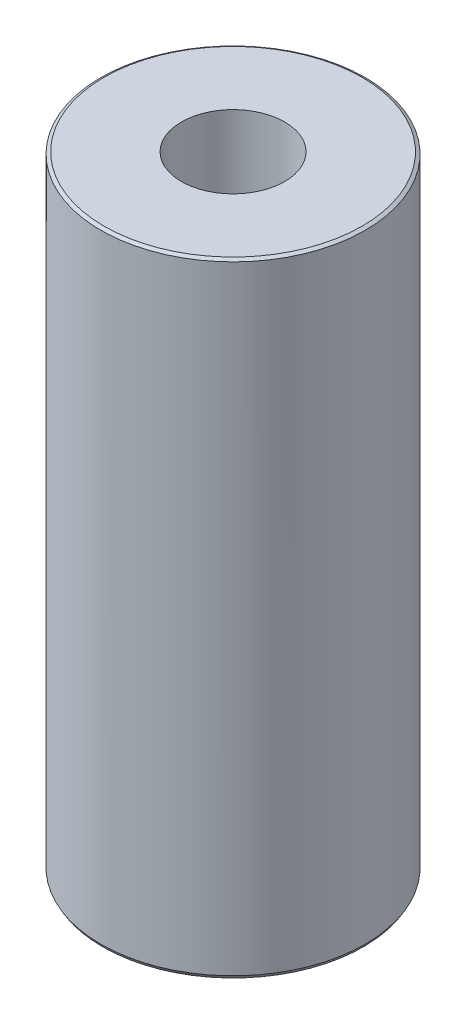
ISO-10303-21;
HEADER;
FILE_DESCRIPTION(('STEP AP214'),'2;1');
FILE_NAME('part.step','',(''),(''),'','','');
FILE_SCHEMA(('AUTOMOTIVE_DESIGN { 1 0 10303 214 1 1 1 1 }'));
ENDSEC;
DATA;
#1=APPLICATION_CONTEXT('core data for automotive mechanical design processes');
#2=APPLICATION_PROTOCOL_DEFINITION('international standard','automotive_design',2000,#1);
#3=PRODUCT_CONTEXT('',#1,'mechanical');
#4=PRODUCT('Part','Part','',(#3));
#5=PRODUCT_RELATED_PRODUCT_CATEGORY('part','',(#4));
#6=PRODUCT_DEFINITION_FORMATION('','',#4);
#7=PRODUCT_DEFINITION_CONTEXT('part definition',#1,'design');
#8=PRODUCT_DEFINITION('design','',#6,#7);
#9=PRODUCT_DEFINITION_SHAPE('','',#8);
#10=(LENGTH_UNIT() NAMED_UNIT(*) SI_UNIT(.MILLI.,.METRE.));
#11=(NAMED_UNIT(*) PLANE_ANGLE_UNIT() SI_UNIT($,.RADIAN.));
#12=(NAMED_UNIT(*) SI_UNIT($,.STERADIAN.) SOLID_ANGLE_UNIT());
#13=UNCERTAINTY_MEASURE_WITH_UNIT(LENGTH_MEASURE(1.E-05),#10,'distance_accuracy_value','');
#14=(GEOMETRIC_REPRESENTATION_CONTEXT(3) GLOBAL_UNCERTAINTY_ASSIGNED_CONTEXT((#13)) GLOBAL_UNIT_ASSIGNED_CONTEXT((#10,
#11,#12)) REPRESENTATION_CONTEXT('',''));
#15=CARTESIAN_POINT('',(0.,0.,0.));
#16=DIRECTION('',(0.,0.,1.));
#17=DIRECTION('',(1.,0.,0.));
#18=AXIS2_PLACEMENT_3D('',#15,#16,#17);
#19=CARTESIAN_POINT('',(0.,117.854066080354,0.));
#20=DIRECTION('',(0.,-1.,0.));
#21=DIRECTION('',(0.,0.,-1.));
#22=AXIS2_PLACEMENT_3D('',#19,#20,#21);
#23=CYLINDRICAL_SURFACE('',#22,25.);
#24=CARTESIAN_POINT('',(0.,117.499102379698,0.));
#25=DIRECTION('',(0.,1.,0.));
#26=DIRECTION('',(0.,0.,1.));
#27=AXIS2_PLACEMENT_3D('',#24,#25,#26);
#28=CIRCLE('',#27,25.);
#29=CARTESIAN_POINT('',(0.,117.499102379698,-25.));
#30=VERTEX_POINT('',#29);
#31=EDGE_CURVE('E50',#30,#30,#28,.F.);
#32=CARTESIAN_POINT('',(0.,0.614815164379293,0.));
#33=DIRECTION('',(0.,1.,0.));
#34=DIRECTION('',(0.,0.,1.));
#35=AXIS2_PLACEMENT_3D('',#32,#33,#34);
#36=CIRCLE('',#35,25.);
#37=CARTESIAN_POINT('',(0.,0.614815164379293,-25.));
#38=VERTEX_POINT('',#37);
#39=EDGE_CURVE('E51',#38,#38,#36,.T.);
#40=CARTESIAN_POINT('',(0.,117.499102379698,-25.));
#41=CARTESIAN_POINT('',(0.,116.281557721205,-25.));
#42=CARTESIAN_POINT('',(0.,115.064013062712,-25.));
#43=CARTESIAN_POINT('',(0.,112.628923745726,-25.));
#44=CARTESIAN_POINT('',(0.,111.411379087234,-25.));
#45=CARTESIAN_POINT('',(0.,108.976289770248,-25.));
#46=CARTESIAN_POINT('',(0.,107.758745111755,-25.));
#47=CARTESIAN_POINT('',(0.,105.323655794769,-25.));
#48=CARTESIAN_POINT('',(0.,104.106111136276,-25.));
#49=CARTESIAN_POINT('',(0.,101.67102181929,-25.));
#50=CARTESIAN_POINT('',(0.,100.453477160797,-25.));
#51=CARTESIAN_POINT('',(0.,98.0183878438116,-25.));
#52=CARTESIAN_POINT('',(0.,96.8008431853187,-25.));
#53=CARTESIAN_POINT('',(0.,94.3657538683329,-25.));
#54=CARTESIAN_POINT('',(0.,93.14820920984,-25.));
#55=CARTESIAN_POINT('',(0.,90.7131198928542,-25.));
#56=CARTESIAN_POINT('',(0.,89.4955752343613,-25.));
#57=CARTESIAN_POINT('',(0.,87.0604859173755,-25.));
#58=CARTESIAN_POINT('',(0.,85.8429412588825,-25.));
#59=CARTESIAN_POINT('',(0.,83.4078519418968,-25.));
#60=CARTESIAN_POINT('',(0.,82.1903072834038,-25.));
#61=CARTESIAN_POINT('',(0.,79.755217966418,-25.));
#62=CARTESIAN_POINT('',(0.,78.5376733079251,-25.));
#63=CARTESIAN_POINT('',(0.,76.1025839909393,-25.));
#64=CARTESIAN_POINT('',(0.,74.8850393324464,-25.));
#65=CARTESIAN_POINT('',(0.,72.4499500154606,-25.));
#66=CARTESIAN_POINT('',(0.,71.2324053569677,-25.));
#67=CARTESIAN_POINT('',(0.,68.7973160399819,-25.));
#68=CARTESIAN_POINT('',(0.,67.579771381489,-25.));
#69=CARTESIAN_POINT('',(0.,65.1446820645032,-25.));
#70=CARTESIAN_POINT('',(0.,63.9271374060103,-25.));
#71=CARTESIAN_POINT('',(0.,61.4920480890245,-25.));
#72=CARTESIAN_POINT('',(0.,60.2745034305316,-25.));
#73=CARTESIAN_POINT('',(0.,57.8394141135458,-25.));
#74=CARTESIAN_POINT('',(0.,56.6218694550529,-25.));
#75=CARTESIAN_POINT('',(0.,54.1867801380671,-25.));
#76=CARTESIAN_POINT('',(0.,52.9692354795741,-25.));
#77=CARTESIAN_POINT('',(0.,50.5341461625883,-25.));
#78=CARTESIAN_POINT('',(0.,49.3166015040954,-25.));
#79=CARTESIAN_POINT('',(0.,46.8815121871096,-25.));
#80=CARTESIAN_POINT('',(0.,45.6639675286167,-25.));
#81=CARTESIAN_POINT('',(0.,43.2288782116309,-25.));
#82=CARTESIAN_POINT('',(0.,42.011333553138,-25.));
#83=CARTESIAN_POINT('',(0.,39.5762442361522,-25.));
#84=CARTESIAN_POINT('',(0.,38.3586995776593,-25.));
#85=CARTESIAN_POINT('',(0.,35.9236102606735,-25.));
#86=CARTESIAN_POINT('',(0.,34.7060656021806,-25.));
#87=CARTESIAN_POINT('',(0.,32.2709762851948,-25.));
#88=CARTESIAN_POINT('',(0.,31.0534316267019,-25.));
#89=CARTESIAN_POINT('',(0.,28.6183423097161,-25.));
#90=CARTESIAN_POINT('',(0.,27.4007976512232,-25.));
#91=CARTESIAN_POINT('',(0.,24.9657083342374,-25.));
#92=CARTESIAN_POINT('',(0.,23.7481636757445,-25.));
#93=CARTESIAN_POINT('',(0.,21.3130743587587,-25.));
#94=CARTESIAN_POINT('',(0.,20.0955297002658,-25.));
#95=CARTESIAN_POINT('',(0.,17.6604403832799,-25.));
#96=CARTESIAN_POINT('',(0.,16.442895724787,-25.));
#97=CARTESIAN_POINT('',(0.,14.0078064078012,-25.));
#98=CARTESIAN_POINT('',(0.,12.7902617493083,-25.));
#99=CARTESIAN_POINT('',(0.,10.3551724323225,-25.));
#100=CARTESIAN_POINT('',(0.,9.13762777382962,-25.));
#101=CARTESIAN_POINT('',(0.,6.70253845684382,-25.));
#102=CARTESIAN_POINT('',(0.,5.48499379835091,-25.));
#103=CARTESIAN_POINT('',(0.,3.0499044813651,-25.));
#104=CARTESIAN_POINT('',(0.,1.8323598228722,-25.));
#105=CARTESIAN_POINT('',(0.,0.614815164379293,-25.));
#106=B_SPLINE_CURVE_WITH_KNOTS('',3,(#40,#41,#42,#43,#44,#45,#46,#47,#48,#49,#50,#51,#52,#53,
#54,#55,#56,#57,#58,#59,#60,#61,#62,#63,#64,#65,#66,#67,#68,#69,#70,#71,#72,#73,#74,#75,#76,#77,
#78,#79,#80,#81,#82,#83,#84,#85,#86,#87,#88,#89,#90,#91,#92,#93,#94,#95,#96,#97,#98,#99,#100,
#101,#102,#103,#104,#105),.UNSPECIFIED.,.F.,.F.,(4,2,2,2,2,2,2,2,2,2,2,2,2,2,2,2,2,2,2,2,2,2,2,
2,2,2,2,2,2,2,2,2,4),(0.,3.6526339754787,7.30526795095741,10.9579019264361,14.6105359019148,
18.2631698773935,21.9158038528723,25.568437828351,29.2210718038297,32.8737057793084,
36.5263397547871,40.1789737302658,43.8316077057445,47.4842416812232,51.1368756567019,
54.7895096321806,58.4421436076594,62.0947775831381,65.7474115586168,69.4000455340955,
73.0526795095742,76.7053134850529,80.3579474605316,84.0105814360103,87.663215411489,
91.3158493869678,94.9684833624465,98.6211173379252,102.273751313404,105.926385288883,
109.579019264361,113.23165323984,116.884287215319),.UNSPECIFIED.);
#107=EDGE_CURVE('BSEAM39',#30,#38,#106,.T.);
#108=ORIENTED_EDGE('',*,*,#31,.T.);
#109=ORIENTED_EDGE('',*,*,#39,.T.);
#110=ORIENTED_EDGE('',*,*,#107,.T.);
#111=ORIENTED_EDGE('',*,*,#107,.F.);
#112=EDGE_LOOP('',(#108,#110,#109,#111));
#113=FACE_BOUND('',#112,.T.);
#114=ADVANCED_FACE('F39',(#113),#23,.T.);
#115=CARTESIAN_POINT('',(0.,117.854066080354,0.));
#116=DIRECTION('',(0.,1.,0.));
#117=DIRECTION('',(0.,0.,1.));
#118=AXIS2_PLACEMENT_3D('',#115,#116,#117);
#119=PLANE('',#118);
#120=CARTESIAN_POINT('',(0.,117.854066080354,0.));
#121=DIRECTION('',(0.,1.,0.));
#122=DIRECTION('',(0.,0.,1.));
#123=AXIS2_PLACEMENT_3D('',#120,#121,#122);
#124=CIRCLE('',#123,24.385184835621);
#125=CARTESIAN_POINT('',(0.,117.854066080354,24.385184835621));
#126=VERTEX_POINT('',#125);
#127=EDGE_CURVE('E54',#126,#126,#124,.T.);
#128=ORIENTED_EDGE('',*,*,#127,.T.);
#129=EDGE_LOOP('',(#128));
#130=FACE_BOUND('',#129,.T.);
#131=CARTESIAN_POINT('',(0.,117.854066080354,0.));
#132=DIRECTION('',(0.,1.,0.));
#133=DIRECTION('',(0.,0.,1.));
#134=AXIS2_PLACEMENT_3D('',#131,#132,#133);
#135=CIRCLE('',#134,9.76173491763838);
#136=CARTESIAN_POINT('',(0.,117.854066080354,-9.76173491763838));
#137=VERTEX_POINT('',#136);
#138=EDGE_CURVE('E58',#137,#137,#135,.T.);
#139=ORIENTED_EDGE('',*,*,#138,.F.);
#140=EDGE_LOOP('',(#139));
#141=FACE_BOUND('',#140,.T.);
#142=ADVANCED_FACE('F69',(#130,#141),#119,.T.);
#143=CARTESIAN_POINT('',(0.,0.,0.));
#144=DIRECTION('',(0.,1.,0.));
#145=DIRECTION('',(0.,0.,1.));
#146=AXIS2_PLACEMENT_3D('',#143,#144,#145);
#147=PLANE('',#146);
#148=CARTESIAN_POINT('',(0.,0.,0.));
#149=DIRECTION('',(0.,1.,0.));
#150=DIRECTION('',(0.,0.,1.));
#151=AXIS2_PLACEMENT_3D('',#148,#149,#150);
#152=CIRCLE('',#151,24.6450362993438);
#153=CARTESIAN_POINT('',(0.,0.,24.6450362993438));
#154=VERTEX_POINT('',#153);
#155=EDGE_CURVE('E10',#154,#154,#152,.F.);
#156=ORIENTED_EDGE('',*,*,#155,.T.);
#157=EDGE_LOOP('',(#156));
#158=FACE_BOUND('',#157,.T.);
#159=CARTESIAN_POINT('',(0.,0.,0.));
#160=DIRECTION('',(0.,1.,0.));
#161=DIRECTION('',(0.,0.,1.));
#162=AXIS2_PLACEMENT_3D('',#159,#160,#161);
#163=CIRCLE('',#162,9.76173491763838);
#164=CARTESIAN_POINT('',(0.,0.,-9.76173491763838));
#165=VERTEX_POINT('',#164);
#166=EDGE_CURVE('E63',#165,#165,#163,.T.);
#167=ORIENTED_EDGE('',*,*,#166,.T.);
#168=EDGE_LOOP('',(#167));
#169=FACE_BOUND('',#168,.T.);
#170=ADVANCED_FACE('F75',(#158,#169),#147,.F.);
#171=CARTESIAN_POINT('',(0.,117.854066080354,0.));
#172=DIRECTION('',(0.,-1.,0.));
#173=DIRECTION('',(0.,0.,-1.));
#174=AXIS2_PLACEMENT_3D('',#171,#172,#173);
#175=CYLINDRICAL_SURFACE('',#174,9.76173491763838);
#176=CARTESIAN_POINT('',(0.,117.854066080354,-9.76173491763838));
#177=CARTESIAN_POINT('',(0.,116.626419558684,-9.76173491763838));
#178=CARTESIAN_POINT('',(0.,115.398773037013,-9.76173491763838));
#179=CARTESIAN_POINT('',(0.,112.943479993673,-9.76173491763838));
#180=CARTESIAN_POINT('',(0.,111.715833472002,-9.76173491763838));
#181=CARTESIAN_POINT('',(0.,109.260540428662,-9.76173491763838));
#182=CARTESIAN_POINT('',(0.,108.032893906991,-9.76173491763838));
#183=CARTESIAN_POINT('',(0.,105.577600863651,-9.76173491763838));
#184=CARTESIAN_POINT('',(0.,104.34995434198,-9.76173491763838));
#185=CARTESIAN_POINT('',(0.,101.894661298639,-9.76173491763838));
#186=CARTESIAN_POINT('',(0.,100.667014776969,-9.76173491763838));
#187=CARTESIAN_POINT('',(0.,98.2117217336284,-9.76173491763838));
#188=CARTESIAN_POINT('',(0.,96.9840752119581,-9.76173491763838));
#189=CARTESIAN_POINT('',(0.,94.5287821686174,-9.76173491763838));
#190=CARTESIAN_POINT('',(0.,93.301135646947,-9.76173491763838));
#191=CARTESIAN_POINT('',(0.,90.8458426036063,-9.76173491763838));
#192=CARTESIAN_POINT('',(0.,89.6181960819359,-9.76173491763838));
#193=CARTESIAN_POINT('',(0.,87.1629030385952,-9.76173491763838));
#194=CARTESIAN_POINT('',(0.,85.9352565169249,-9.76173491763838));
#195=CARTESIAN_POINT('',(0.,83.4799634735842,-9.76173491763838));
#196=CARTESIAN_POINT('',(0.,82.2523169519138,-9.76173491763838));
#197=CARTESIAN_POINT('',(0.,79.7970239085731,-9.76173491763838));
#198=CARTESIAN_POINT('',(0.,78.5693773869027,-9.76173491763838));
#199=CARTESIAN_POINT('',(0.,76.114084343562,-9.76173491763838));
#200=CARTESIAN_POINT('',(0.,74.8864378218917,-9.76173491763838));
#201=CARTESIAN_POINT('',(0.,72.431144778551,-9.76173491763838));
#202=CARTESIAN_POINT('',(0.,71.2034982568806,-9.76173491763838));
#203=CARTESIAN_POINT('',(0.,68.7482052135399,-9.76173491763838));
#204=CARTESIAN_POINT('',(0.,67.5205586918695,-9.76173491763838));
#205=CARTESIAN_POINT('',(0.,65.0652656485288,-9.76173491763838));
#206=CARTESIAN_POINT('',(0.,63.8376191268585,-9.76173491763838));
#207=CARTESIAN_POINT('',(0.,61.3823260835178,-9.76173491763838));
#208=CARTESIAN_POINT('',(0.,60.1546795618474,-9.76173491763838));
#209=CARTESIAN_POINT('',(0.,57.6993865185067,-9.76173491763838));
#210=CARTESIAN_POINT('',(0.,56.4717399968363,-9.76173491763838));
#211=CARTESIAN_POINT('',(0.,54.0164469534956,-9.76173491763838));
#212=CARTESIAN_POINT('',(0.,52.7888004318253,-9.76173491763838));
#213=CARTESIAN_POINT('',(0.,50.3335073884846,-9.76173491763838));
#214=CARTESIAN_POINT('',(0.,49.1058608668142,-9.76173491763838));
#215=CARTESIAN_POINT('',(0.,46.6505678234735,-9.76173491763838));
#216=CARTESIAN_POINT('',(0.,45.4229213018031,-9.76173491763838));
#217=CARTESIAN_POINT('',(0.,42.9676282584624,-9.76173491763838));
#218=CARTESIAN_POINT('',(0.,41.7399817367921,-9.76173491763838));
#219=CARTESIAN_POINT('',(0.,39.2846886934514,-9.76173491763838));
#220=CARTESIAN_POINT('',(0.,38.057042171781,-9.76173491763838));
#221=CARTESIAN_POINT('',(0.,35.6017491284403,-9.76173491763838));
#222=CARTESIAN_POINT('',(0.,34.3741026067699,-9.76173491763838));
#223=CARTESIAN_POINT('',(0.,31.9188095634292,-9.76173491763838));
#224=CARTESIAN_POINT('',(0.,30.6911630417589,-9.76173491763838));
#225=CARTESIAN_POINT('',(0.,28.2358699984182,-9.76173491763838));
#226=CARTESIAN_POINT('',(0.,27.0082234767478,-9.76173491763838));
#227=CARTESIAN_POINT('',(0.,24.5529304334071,-9.76173491763838));
#228=CARTESIAN_POINT('',(0.,23.3252839117367,-9.76173491763838));
#229=CARTESIAN_POINT('',(0.,20.869990868396,-9.76173491763838));
#230=CARTESIAN_POINT('',(0.,19.6423443467257,-9.76173491763838));
#231=CARTESIAN_POINT('',(0.,17.187051303385,-9.76173491763838));
#232=CARTESIAN_POINT('',(0.,15.9594047817146,-9.76173491763838));
#233=CARTESIAN_POINT('',(0.,13.5041117383739,-9.76173491763838));
#234=CARTESIAN_POINT('',(0.,12.2764652167035,-9.76173491763838));
#235=CARTESIAN_POINT('',(0.,9.82117217336283,-9.76173491763838));
#236=CARTESIAN_POINT('',(0.,8.59352565169248,-9.76173491763838));
#237=CARTESIAN_POINT('',(0.,6.13823260835176,-9.76173491763838));
#238=CARTESIAN_POINT('',(0.,4.91058608668141,-9.76173491763838));
#239=CARTESIAN_POINT('',(0.,2.45529304334069,-9.76173491763838));
#240=CARTESIAN_POINT('',(0.,1.22764652167034,-9.76173491763838));
#241=CARTESIAN_POINT('',(0.,0.,-9.76173491763838));
#242=B_SPLINE_CURVE_WITH_KNOTS('',3,(#176,#177,#178,#179,#180,#181,#182,#183,#184,#185,#186,
#187,#188,#189,#190,#191,#192,#193,#194,#195,#196,#197,#198,#199,#200,#201,#202,#203,#204,#205,
#206,#207,#208,#209,#210,#211,#212,#213,#214,#215,#216,#217,#218,#219,#220,#221,#222,#223,#224,
#225,#226,#227,#228,#229,#230,#231,#232,#233,#234,#235,#236,#237,#238,#239,#240,#241),
.UNSPECIFIED.,.F.,.F.,(4,2,2,2,2,2,2,2,2,2,2,2,2,2,2,2,2,2,2,2,2,2,2,2,2,2,2,2,2,2,2,2,4),(0.,
3.68293956501106,7.36587913002212,11.0488186950332,14.7317582600443,18.4146978250553,
22.0976373900664,25.7805769550775,29.4635165200885,33.1464560850996,36.8293956501107,
40.5123352151217,44.1952747801328,47.8782143451438,51.5611539101549,55.244093475166,
58.9270330401771,62.6099726051881,66.2929121701992,69.9758517352103,73.6587913002213,
77.3417308652324,81.0246704302435,84.7076099952545,88.3905495602656,92.0734891252767,
95.7564286902877,99.4393682552988,103.12230782031,106.805247385321,110.488186950332,
114.171126515343,117.854066080354),.UNSPECIFIED.);
#243=EDGE_CURVE('BSEAM70',#137,#165,#242,.T.);
#244=ORIENTED_EDGE('',*,*,#138,.T.);
#245=ORIENTED_EDGE('',*,*,#166,.F.);
#246=ORIENTED_EDGE('',*,*,#243,.T.);
#247=ORIENTED_EDGE('',*,*,#243,.F.);
#248=EDGE_LOOP('',(#244,#246,#245,#247));
#249=FACE_BOUND('',#248,.T.);
#250=ADVANCED_FACE('F70',(#249),#175,.F.);
#251=CARTESIAN_POINT('',(0.,117.854066080354,0.));
#252=DIRECTION('',(0.,-1.,0.));
#253=DIRECTION('',(0.,0.,-1.));
#254=AXIS2_PLACEMENT_3D('',#251,#252,#253);
#255=CONICAL_SURFACE('',#254,24.385184835621,1.0471975511966);
#256=ORIENTED_EDGE('',*,*,#31,.F.);
#257=EDGE_LOOP('',(#256));
#258=FACE_BOUND('',#257,.T.);
#259=ORIENTED_EDGE('',*,*,#127,.F.);
#260=EDGE_LOOP('',(#259));
#261=FACE_BOUND('',#260,.T.);
#262=ADVANCED_FACE('F81',(#258,#261),#255,.T.);
#263=CARTESIAN_POINT('',(0.,0.614815164379293,0.));
#264=DIRECTION('',(0.,1.,0.));
#265=DIRECTION('',(0.,0.,1.));
#266=AXIS2_PLACEMENT_3D('',#263,#264,#265);
#267=CONICAL_SURFACE('',#266,25.,0.523598775598298);
#268=ORIENTED_EDGE('',*,*,#155,.F.);
#269=EDGE_LOOP('',(#268));
#270=FACE_BOUND('',#269,.T.);
#271=ORIENTED_EDGE('',*,*,#39,.F.);
#272=EDGE_LOOP('',(#271));
#273=FACE_BOUND('',#272,.T.);
#274=ADVANCED_FACE('F45',(#270,#273),#267,.T.);
#275=CLOSED_SHELL('',(#114,#142,#170,#250,#262,#274));
#276=MANIFOLD_SOLID_BREP('B2',#275);
#277=ADVANCED_BREP_SHAPE_REPRESENTATION('',(#18,#276),#14);
#278=SHAPE_DEFINITION_REPRESENTATION(#9,#277);
ENDSEC;
END-ISO-10303-21;
